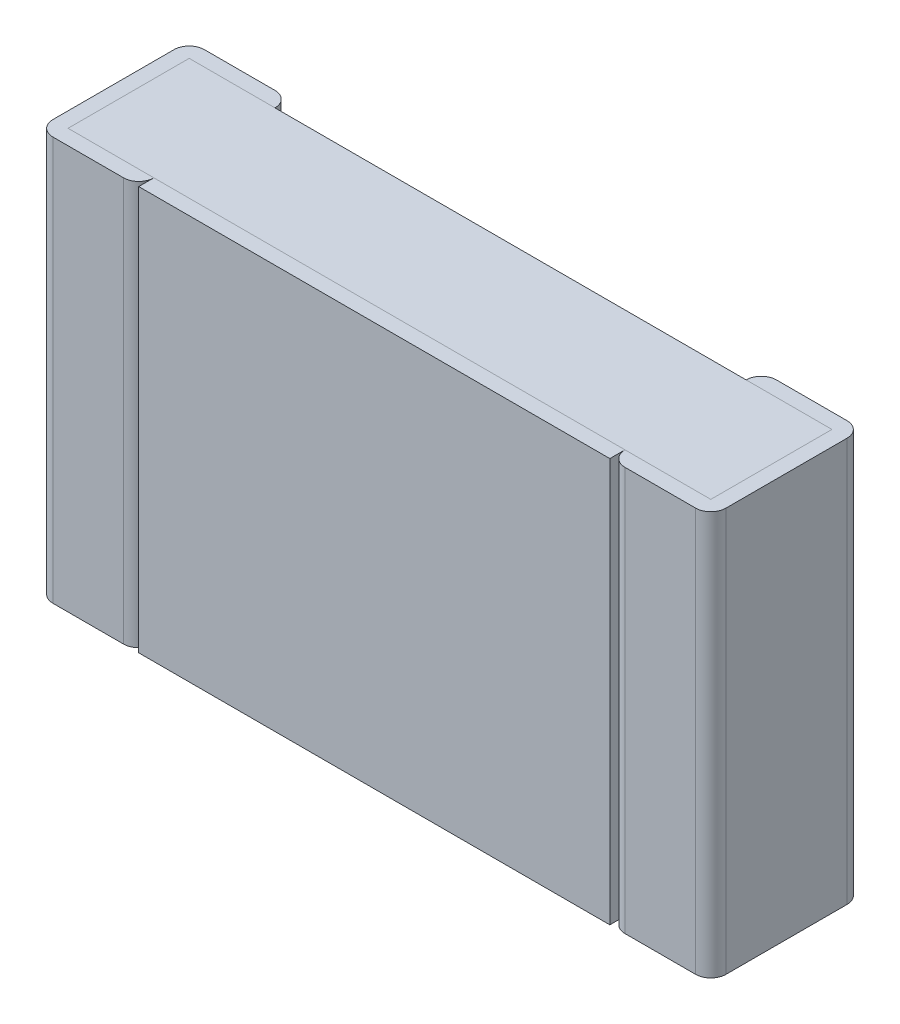
ISO-10303-21;
HEADER;
FILE_DESCRIPTION(('STEP AP214'),'2;1');
FILE_NAME('part.step','',(''),(''),'','','');
FILE_SCHEMA(('AUTOMOTIVE_DESIGN { 1 0 10303 214 1 1 1 1 }'));
ENDSEC;
DATA;
#1=APPLICATION_CONTEXT('core data for automotive mechanical design processes');
#2=APPLICATION_PROTOCOL_DEFINITION('international standard','automotive_design',2000,#1);
#3=PRODUCT_CONTEXT('',#1,'mechanical');
#4=PRODUCT('Part','Part','',(#3));
#5=PRODUCT_RELATED_PRODUCT_CATEGORY('part','',(#4));
#6=PRODUCT_DEFINITION_FORMATION('','',#4);
#7=PRODUCT_DEFINITION_CONTEXT('part definition',#1,'design');
#8=PRODUCT_DEFINITION('design','',#6,#7);
#9=PRODUCT_DEFINITION_SHAPE('','',#8);
#10=(LENGTH_UNIT() NAMED_UNIT(*) SI_UNIT(.MILLI.,.METRE.));
#11=(NAMED_UNIT(*) PLANE_ANGLE_UNIT() SI_UNIT($,.RADIAN.));
#12=(NAMED_UNIT(*) SI_UNIT($,.STERADIAN.) SOLID_ANGLE_UNIT());
#13=UNCERTAINTY_MEASURE_WITH_UNIT(LENGTH_MEASURE(1.E-05),#10,'distance_accuracy_value','');
#14=(GEOMETRIC_REPRESENTATION_CONTEXT(3) GLOBAL_UNCERTAINTY_ASSIGNED_CONTEXT((#13)) GLOBAL_UNIT_ASSIGNED_CONTEXT((#10,
#11,#12)) REPRESENTATION_CONTEXT('',''));
#15=CARTESIAN_POINT('',(0.,0.,0.));
#16=DIRECTION('',(0.,0.,1.));
#17=DIRECTION('',(1.,0.,0.));
#18=AXIS2_PLACEMENT_3D('',#15,#16,#17);
#19=CARTESIAN_POINT('',(-1.,-0.6,0.));
#20=DIRECTION('',(1.,0.,0.));
#21=DIRECTION('',(0.,1.,0.));
#22=AXIS2_PLACEMENT_3D('',#19,#20,#21);
#23=PLANE('',#22);
#24=DIRECTION('',(0.,1.,0.));
#25=VECTOR('',#24,1.);
#26=CARTESIAN_POINT('',(-1.,-0.6,0.405));
#27=LINE('',#26,#25);
#28=CARTESIAN_POINT('',(-1.,-0.6,0.405));
#29=VERTEX_POINT('',#28);
#30=CARTESIAN_POINT('',(-1.,0.6,0.405));
#31=VERTEX_POINT('',#30);
#32=EDGE_CURVE('E11',#29,#31,#27,.T.);
#33=ORIENTED_EDGE('',*,*,#32,.T.);
#34=DIRECTION('',(0.,0.,1.));
#35=VECTOR('',#34,1.);
#36=CARTESIAN_POINT('',(-1.,0.6,0.));
#37=LINE('',#36,#35);
#38=CARTESIAN_POINT('',(-1.,0.6,0.045));
#39=VERTEX_POINT('',#38);
#40=EDGE_CURVE('E41',#39,#31,#37,.T.);
#41=ORIENTED_EDGE('',*,*,#40,.F.);
#42=DIRECTION('',(0.,1.,0.));
#43=VECTOR('',#42,1.);
#44=CARTESIAN_POINT('',(-1.,-0.6,0.045));
#45=LINE('',#44,#43);
#46=CARTESIAN_POINT('',(-1.,-0.6,0.045));
#47=VERTEX_POINT('',#46);
#48=EDGE_CURVE('E252',#47,#39,#45,.T.);
#49=ORIENTED_EDGE('',*,*,#48,.F.);
#50=DIRECTION('',(0.,0.,1.));
#51=VECTOR('',#50,1.);
#52=CARTESIAN_POINT('',(-1.,-0.6,0.));
#53=LINE('',#52,#51);
#54=EDGE_CURVE('E27',#47,#29,#53,.T.);
#55=ORIENTED_EDGE('',*,*,#54,.T.);
#56=EDGE_LOOP('',(#33,#41,#49,#55));
#57=FACE_BOUND('',#56,.T.);
#58=ADVANCED_FACE('F16',(#57),#23,.F.);
#59=CARTESIAN_POINT('',(-1.,-0.6,0.));
#60=DIRECTION('',(0.,1.,0.));
#61=DIRECTION('',(1.,0.,0.));
#62=AXIS2_PLACEMENT_3D('',#59,#60,#61);
#63=PLANE('',#62);
#64=CARTESIAN_POINT('',(-0.745,-0.6,0.045));
#65=DIRECTION('',(0.,1.,0.));
#66=DIRECTION('',(0.,0.,1.));
#67=AXIS2_PLACEMENT_3D('',#64,#65,#66);
#68=CIRCLE('',#67,0.045);
#69=CARTESIAN_POINT('',(-0.7,-0.6,0.045));
#70=VERTEX_POINT('',#69);
#71=CARTESIAN_POINT('',(-0.745,-0.6,0.));
#72=VERTEX_POINT('',#71);
#73=EDGE_CURVE('E214',#70,#72,#68,.T.);
#74=ORIENTED_EDGE('',*,*,#73,.F.);
#75=DIRECTION('',(1.,0.,0.));
#76=VECTOR('',#75,1.);
#77=CARTESIAN_POINT('',(-0.955,-0.6,0.045));
#78=LINE('',#77,#76);
#79=CARTESIAN_POINT('',(-0.955,-0.6,0.045));
#80=VERTEX_POINT('',#79);
#81=EDGE_CURVE('E199',#80,#70,#78,.T.);
#82=ORIENTED_EDGE('',*,*,#81,.F.);
#83=DIRECTION('',(0.,0.,1.));
#84=VECTOR('',#83,1.);
#85=CARTESIAN_POINT('',(-0.955,-0.6,0.045));
#86=LINE('',#85,#84);
#87=CARTESIAN_POINT('',(-0.955,-0.6,0.405));
#88=VERTEX_POINT('',#87);
#89=EDGE_CURVE('E320',#80,#88,#86,.T.);
#90=ORIENTED_EDGE('',*,*,#89,.T.);
#91=DIRECTION('',(1.,0.,0.));
#92=VECTOR('',#91,1.);
#93=CARTESIAN_POINT('',(-0.955,-0.6,0.405));
#94=LINE('',#93,#92);
#95=CARTESIAN_POINT('',(-0.7,-0.6,0.405));
#96=VERTEX_POINT('',#95);
#97=EDGE_CURVE('E388',#88,#96,#94,.T.);
#98=ORIENTED_EDGE('',*,*,#97,.T.);
#99=CARTESIAN_POINT('',(-0.745,-0.6,0.405));
#100=DIRECTION('',(0.,-1.,0.));
#101=DIRECTION('',(0.,0.,1.));
#102=AXIS2_PLACEMENT_3D('',#99,#100,#101);
#103=CIRCLE('',#102,0.045);
#104=CARTESIAN_POINT('',(-0.745,-0.6,0.45));
#105=VERTEX_POINT('',#104);
#106=EDGE_CURVE('E344',#96,#105,#103,.T.);
#107=ORIENTED_EDGE('',*,*,#106,.T.);
#108=DIRECTION('',(1.,0.,0.));
#109=VECTOR('',#108,1.);
#110=CARTESIAN_POINT('',(-1.,-0.6,0.45));
#111=LINE('',#110,#109);
#112=CARTESIAN_POINT('',(-0.955,-0.6,0.45));
#113=VERTEX_POINT('',#112);
#114=EDGE_CURVE('E205',#113,#105,#111,.T.);
#115=ORIENTED_EDGE('',*,*,#114,.F.);
#116=CARTESIAN_POINT('',(-0.955,-0.6,0.405));
#117=DIRECTION('',(0.,1.,0.));
#118=DIRECTION('',(0.,0.,1.));
#119=AXIS2_PLACEMENT_3D('',#116,#117,#118);
#120=CIRCLE('',#119,0.045);
#121=EDGE_CURVE('E209',#29,#113,#120,.T.);
#122=ORIENTED_EDGE('',*,*,#121,.F.);
#123=ORIENTED_EDGE('',*,*,#54,.F.);
#124=CARTESIAN_POINT('',(-0.955,-0.6,0.045));
#125=DIRECTION('',(0.,-1.,0.));
#126=DIRECTION('',(0.,0.,1.));
#127=AXIS2_PLACEMENT_3D('',#124,#125,#126);
#128=CIRCLE('',#127,0.045);
#129=CARTESIAN_POINT('',(-0.955,-0.6,0.));
#130=VERTEX_POINT('',#129);
#131=EDGE_CURVE('E251',#47,#130,#128,.T.);
#132=ORIENTED_EDGE('',*,*,#131,.T.);
#133=DIRECTION('',(1.,0.,0.));
#134=VECTOR('',#133,1.);
#135=CARTESIAN_POINT('',(-1.,-0.6,0.));
#136=LINE('',#135,#134);
#137=EDGE_CURVE('E247',#130,#72,#136,.T.);
#138=ORIENTED_EDGE('',*,*,#137,.T.);
#139=EDGE_LOOP('',(#74,#82,#90,#98,#107,#115,#122,#123,#132,#138));
#140=FACE_BOUND('',#139,.T.);
#141=ADVANCED_FACE('F447',(#140),#63,.F.);
#142=CARTESIAN_POINT('',(-0.955,-0.6,0.045));
#143=DIRECTION('',(0.,1.,0.));
#144=DIRECTION('',(-1.,0.,0.));
#145=AXIS2_PLACEMENT_3D('',#142,#143,#144);
#146=CYLINDRICAL_SURFACE('',#145,0.045);
#147=ORIENTED_EDGE('',*,*,#48,.T.);
#148=CARTESIAN_POINT('',(-0.955,0.6,0.045));
#149=DIRECTION('',(0.,-1.,0.));
#150=DIRECTION('',(0.,0.,1.));
#151=AXIS2_PLACEMENT_3D('',#148,#149,#150);
#152=CIRCLE('',#151,0.045);
#153=CARTESIAN_POINT('',(-0.955,0.6,0.));
#154=VERTEX_POINT('',#153);
#155=EDGE_CURVE('E381',#39,#154,#152,.T.);
#156=ORIENTED_EDGE('',*,*,#155,.T.);
#157=DIRECTION('',(0.,1.,0.));
#158=VECTOR('',#157,1.);
#159=CARTESIAN_POINT('',(-0.955,-0.6,0.));
#160=LINE('',#159,#158);
#161=EDGE_CURVE('E215',#130,#154,#160,.T.);
#162=ORIENTED_EDGE('',*,*,#161,.F.);
#163=ORIENTED_EDGE('',*,*,#131,.F.);
#164=EDGE_LOOP('',(#147,#156,#162,#163));
#165=FACE_BOUND('',#164,.T.);
#166=ADVANCED_FACE('F540',(#165),#146,.T.);
#167=CARTESIAN_POINT('',(-0.955,-0.6,0.405));
#168=DIRECTION('',(0.,1.,0.));
#169=DIRECTION('',(-1.,0.,0.));
#170=AXIS2_PLACEMENT_3D('',#167,#168,#169);
#171=CYLINDRICAL_SURFACE('',#170,0.045);
#172=ORIENTED_EDGE('',*,*,#121,.T.);
#173=DIRECTION('',(0.,1.,0.));
#174=VECTOR('',#173,1.);
#175=CARTESIAN_POINT('',(-0.955,-0.6,0.45));
#176=LINE('',#175,#174);
#177=CARTESIAN_POINT('',(-0.955,0.6,0.45));
#178=VERTEX_POINT('',#177);
#179=EDGE_CURVE('E253',#113,#178,#176,.T.);
#180=ORIENTED_EDGE('',*,*,#179,.T.);
#181=CARTESIAN_POINT('',(-0.955,0.6,0.405));
#182=DIRECTION('',(0.,1.,0.));
#183=DIRECTION('',(0.,0.,1.));
#184=AXIS2_PLACEMENT_3D('',#181,#182,#183);
#185=CIRCLE('',#184,0.045);
#186=EDGE_CURVE('E271',#31,#178,#185,.T.);
#187=ORIENTED_EDGE('',*,*,#186,.F.);
#188=ORIENTED_EDGE('',*,*,#32,.F.);
#189=EDGE_LOOP('',(#172,#180,#187,#188));
#190=FACE_BOUND('',#189,.T.);
#191=ADVANCED_FACE('F521',(#190),#171,.T.);
#192=CARTESIAN_POINT('',(-1.,0.6,0.));
#193=DIRECTION('',(0.,1.,0.));
#194=DIRECTION('',(1.,0.,0.));
#195=AXIS2_PLACEMENT_3D('',#192,#193,#194);
#196=PLANE('',#195);
#197=DIRECTION('',(1.,0.,0.));
#198=VECTOR('',#197,1.);
#199=CARTESIAN_POINT('',(-1.,0.6,0.));
#200=LINE('',#199,#198);
#201=CARTESIAN_POINT('',(-0.745,0.6,0.));
#202=VERTEX_POINT('',#201);
#203=EDGE_CURVE('E219',#154,#202,#200,.T.);
#204=ORIENTED_EDGE('',*,*,#203,.F.);
#205=ORIENTED_EDGE('',*,*,#155,.F.);
#206=ORIENTED_EDGE('',*,*,#40,.T.);
#207=ORIENTED_EDGE('',*,*,#186,.T.);
#208=DIRECTION('',(1.,0.,0.));
#209=VECTOR('',#208,1.);
#210=CARTESIAN_POINT('',(-1.,0.6,0.45));
#211=LINE('',#210,#209);
#212=CARTESIAN_POINT('',(-0.745,0.6,0.45));
#213=VERTEX_POINT('',#212);
#214=EDGE_CURVE('E267',#178,#213,#211,.T.);
#215=ORIENTED_EDGE('',*,*,#214,.T.);
#216=CARTESIAN_POINT('',(-0.745,0.6,0.405));
#217=DIRECTION('',(0.,-1.,0.));
#218=DIRECTION('',(0.,0.,1.));
#219=AXIS2_PLACEMENT_3D('',#216,#217,#218);
#220=CIRCLE('',#219,0.045);
#221=CARTESIAN_POINT('',(-0.7,0.6,0.405));
#222=VERTEX_POINT('',#221);
#223=EDGE_CURVE('E314',#222,#213,#220,.T.);
#224=ORIENTED_EDGE('',*,*,#223,.F.);
#225=DIRECTION('',(1.,0.,0.));
#226=VECTOR('',#225,1.);
#227=CARTESIAN_POINT('',(-0.955,0.6,0.405));
#228=LINE('',#227,#226);
#229=CARTESIAN_POINT('',(-0.955,0.6,0.405));
#230=VERTEX_POINT('',#229);
#231=EDGE_CURVE('E220',#230,#222,#228,.T.);
#232=ORIENTED_EDGE('',*,*,#231,.F.);
#233=DIRECTION('',(0.,0.,1.));
#234=VECTOR('',#233,1.);
#235=CARTESIAN_POINT('',(-0.955,0.6,0.045));
#236=LINE('',#235,#234);
#237=CARTESIAN_POINT('',(-0.955,0.6,0.045));
#238=VERTEX_POINT('',#237);
#239=EDGE_CURVE('E224',#238,#230,#236,.T.);
#240=ORIENTED_EDGE('',*,*,#239,.F.);
#241=DIRECTION('',(1.,0.,0.));
#242=VECTOR('',#241,1.);
#243=CARTESIAN_POINT('',(-0.955,0.6,0.045));
#244=LINE('',#243,#242);
#245=CARTESIAN_POINT('',(-0.7,0.6,0.045));
#246=VERTEX_POINT('',#245);
#247=EDGE_CURVE('E272',#238,#246,#244,.T.);
#248=ORIENTED_EDGE('',*,*,#247,.T.);
#249=CARTESIAN_POINT('',(-0.745,0.6,0.045));
#250=DIRECTION('',(0.,1.,0.));
#251=DIRECTION('',(0.,0.,1.));
#252=AXIS2_PLACEMENT_3D('',#249,#250,#251);
#253=CIRCLE('',#252,0.045);
#254=EDGE_CURVE('E218',#246,#202,#253,.T.);
#255=ORIENTED_EDGE('',*,*,#254,.T.);
#256=EDGE_LOOP('',(#204,#205,#206,#207,#215,#224,#232,#240,#248,#255));
#257=FACE_BOUND('',#256,.T.);
#258=ADVANCED_FACE('F528',(#257),#196,.T.);
#259=CARTESIAN_POINT('',(-1.,-0.6,0.));
#260=DIRECTION('',(0.,0.,1.));
#261=DIRECTION('',(1.,0.,0.));
#262=AXIS2_PLACEMENT_3D('',#259,#260,#261);
#263=PLANE('',#262);
#264=DIRECTION('',(0.,1.,0.));
#265=VECTOR('',#264,1.);
#266=CARTESIAN_POINT('',(-0.745,-0.6,0.));
#267=LINE('',#266,#265);
#268=EDGE_CURVE('E211',#72,#202,#267,.T.);
#269=ORIENTED_EDGE('',*,*,#268,.F.);
#270=ORIENTED_EDGE('',*,*,#137,.F.);
#271=ORIENTED_EDGE('',*,*,#161,.T.);
#272=ORIENTED_EDGE('',*,*,#203,.T.);
#273=EDGE_LOOP('',(#269,#270,#271,#272));
#274=FACE_BOUND('',#273,.T.);
#275=ADVANCED_FACE('F536',(#274),#263,.F.);
#276=CARTESIAN_POINT('',(-0.745,-0.6,0.045));
#277=DIRECTION('',(0.,1.,0.));
#278=DIRECTION('',(1.,0.,0.));
#279=AXIS2_PLACEMENT_3D('',#276,#277,#278);
#280=CYLINDRICAL_SURFACE('',#279,0.045);
#281=ORIENTED_EDGE('',*,*,#73,.T.);
#282=ORIENTED_EDGE('',*,*,#268,.T.);
#283=ORIENTED_EDGE('',*,*,#254,.F.);
#284=DIRECTION('',(0.,1.,0.));
#285=VECTOR('',#284,1.);
#286=CARTESIAN_POINT('',(-0.7,-0.6,0.045));
#287=LINE('',#286,#285);
#288=EDGE_CURVE('E276',#70,#246,#287,.T.);
#289=ORIENTED_EDGE('',*,*,#288,.F.);
#290=EDGE_LOOP('',(#281,#282,#283,#289));
#291=FACE_BOUND('',#290,.T.);
#292=ADVANCED_FACE('F534',(#291),#280,.T.);
#293=CARTESIAN_POINT('',(-0.955,-0.6,0.045));
#294=DIRECTION('',(0.,1.,0.));
#295=DIRECTION('',(1.,0.,0.));
#296=AXIS2_PLACEMENT_3D('',#293,#294,#295);
#297=PLANE('',#296);
#298=DIRECTION('',(1.,0.,0.));
#299=VECTOR('',#298,1.);
#300=CARTESIAN_POINT('',(-0.955,-0.6,0.045));
#301=LINE('',#300,#299);
#302=CARTESIAN_POINT('',(0.7,-0.6,0.045));
#303=VERTEX_POINT('',#302);
#304=EDGE_CURVE('E190',#70,#303,#301,.T.);
#305=ORIENTED_EDGE('',*,*,#304,.T.);
#306=DIRECTION('',(1.,0.,0.));
#307=VECTOR('',#306,1.);
#308=CARTESIAN_POINT('',(-0.955,-0.6,0.045));
#309=LINE('',#308,#307);
#310=CARTESIAN_POINT('',(0.955,-0.6,0.045));
#311=VERTEX_POINT('',#310);
#312=EDGE_CURVE('E182',#303,#311,#309,.T.);
#313=ORIENTED_EDGE('',*,*,#312,.T.);
#314=DIRECTION('',(0.,0.,1.));
#315=VECTOR('',#314,1.);
#316=CARTESIAN_POINT('',(0.955,-0.6,0.045));
#317=LINE('',#316,#315);
#318=CARTESIAN_POINT('',(0.955,-0.6,0.405));
#319=VERTEX_POINT('',#318);
#320=EDGE_CURVE('E186',#311,#319,#317,.T.);
#321=ORIENTED_EDGE('',*,*,#320,.T.);
#322=DIRECTION('',(1.,0.,0.));
#323=VECTOR('',#322,1.);
#324=CARTESIAN_POINT('',(-0.955,-0.6,0.405));
#325=LINE('',#324,#323);
#326=CARTESIAN_POINT('',(0.7,-0.6,0.405));
#327=VERTEX_POINT('',#326);
#328=EDGE_CURVE('E197',#327,#319,#325,.T.);
#329=ORIENTED_EDGE('',*,*,#328,.F.);
#330=DIRECTION('',(1.,0.,0.));
#331=VECTOR('',#330,1.);
#332=CARTESIAN_POINT('',(-0.7,-0.6,0.405));
#333=LINE('',#332,#331);
#334=EDGE_CURVE('E304',#96,#327,#333,.T.);
#335=ORIENTED_EDGE('',*,*,#334,.F.);
#336=ORIENTED_EDGE('',*,*,#97,.F.);
#337=ORIENTED_EDGE('',*,*,#89,.F.);
#338=ORIENTED_EDGE('',*,*,#81,.T.);
#339=EDGE_LOOP('',(#305,#313,#321,#329,#335,#336,#337,#338));
#340=FACE_BOUND('',#339,.T.);
#341=ADVANCED_FACE('F184',(#340),#297,.F.);
#342=CARTESIAN_POINT('',(-1.,-0.6,0.45));
#343=DIRECTION('',(0.,0.,1.));
#344=DIRECTION('',(1.,0.,0.));
#345=AXIS2_PLACEMENT_3D('',#342,#343,#344);
#346=PLANE('',#345);
#347=ORIENTED_EDGE('',*,*,#214,.F.);
#348=ORIENTED_EDGE('',*,*,#179,.F.);
#349=ORIENTED_EDGE('',*,*,#114,.T.);
#350=DIRECTION('',(0.,1.,0.));
#351=VECTOR('',#350,1.);
#352=CARTESIAN_POINT('',(-0.745,-0.6,0.45));
#353=LINE('',#352,#351);
#354=EDGE_CURVE('E257',#105,#213,#353,.T.);
#355=ORIENTED_EDGE('',*,*,#354,.T.);
#356=EDGE_LOOP('',(#347,#348,#349,#355));
#357=FACE_BOUND('',#356,.T.);
#358=ADVANCED_FACE('F526',(#357),#346,.T.);
#359=CARTESIAN_POINT('',(-0.745,-0.6,0.405));
#360=DIRECTION('',(0.,1.,0.));
#361=DIRECTION('',(1.,0.,0.));
#362=AXIS2_PLACEMENT_3D('',#359,#360,#361);
#363=CYLINDRICAL_SURFACE('',#362,0.045);
#364=DIRECTION('',(0.,1.,0.));
#365=VECTOR('',#364,1.);
#366=CARTESIAN_POINT('',(-0.7,-0.6,0.405));
#367=LINE('',#366,#365);
#368=EDGE_CURVE('E261',#96,#222,#367,.T.);
#369=ORIENTED_EDGE('',*,*,#368,.T.);
#370=ORIENTED_EDGE('',*,*,#223,.T.);
#371=ORIENTED_EDGE('',*,*,#354,.F.);
#372=ORIENTED_EDGE('',*,*,#106,.F.);
#373=EDGE_LOOP('',(#369,#370,#371,#372));
#374=FACE_BOUND('',#373,.T.);
#375=ADVANCED_FACE('F441',(#374),#363,.T.);
#376=CARTESIAN_POINT('',(-0.955,0.6,0.045));
#377=DIRECTION('',(0.,1.,0.));
#378=DIRECTION('',(1.,0.,0.));
#379=AXIS2_PLACEMENT_3D('',#376,#377,#378);
#380=PLANE('',#379);
#381=ORIENTED_EDGE('',*,*,#247,.F.);
#382=ORIENTED_EDGE('',*,*,#239,.T.);
#383=ORIENTED_EDGE('',*,*,#231,.T.);
#384=DIRECTION('',(1.,0.,0.));
#385=VECTOR('',#384,1.);
#386=CARTESIAN_POINT('',(-0.7,0.6,0.405));
#387=LINE('',#386,#385);
#388=CARTESIAN_POINT('',(0.7,0.6,0.405));
#389=VERTEX_POINT('',#388);
#390=EDGE_CURVE('E225',#222,#389,#387,.T.);
#391=ORIENTED_EDGE('',*,*,#390,.T.);
#392=DIRECTION('',(1.,0.,0.));
#393=VECTOR('',#392,1.);
#394=CARTESIAN_POINT('',(-0.955,0.6,0.405));
#395=LINE('',#394,#393);
#396=CARTESIAN_POINT('',(0.955,0.6,0.405));
#397=VERTEX_POINT('',#396);
#398=EDGE_CURVE('E234',#389,#397,#395,.T.);
#399=ORIENTED_EDGE('',*,*,#398,.T.);
#400=DIRECTION('',(0.,0.,1.));
#401=VECTOR('',#400,1.);
#402=CARTESIAN_POINT('',(0.955,0.6,0.045));
#403=LINE('',#402,#401);
#404=CARTESIAN_POINT('',(0.955,0.6,0.045));
#405=VERTEX_POINT('',#404);
#406=EDGE_CURVE('E299',#405,#397,#403,.T.);
#407=ORIENTED_EDGE('',*,*,#406,.F.);
#408=DIRECTION('',(1.,0.,0.));
#409=VECTOR('',#408,1.);
#410=CARTESIAN_POINT('',(-0.955,0.6,0.045));
#411=LINE('',#410,#409);
#412=CARTESIAN_POINT('',(0.7,0.6,0.045));
#413=VERTEX_POINT('',#412);
#414=EDGE_CURVE('E303',#413,#405,#411,.T.);
#415=ORIENTED_EDGE('',*,*,#414,.F.);
#416=DIRECTION('',(1.,0.,0.));
#417=VECTOR('',#416,1.);
#418=CARTESIAN_POINT('',(-0.955,0.6,0.045));
#419=LINE('',#418,#417);
#420=EDGE_CURVE('E237',#246,#413,#419,.T.);
#421=ORIENTED_EDGE('',*,*,#420,.F.);
#422=EDGE_LOOP('',(#381,#382,#383,#391,#399,#407,#415,#421));
#423=FACE_BOUND('',#422,.T.);
#424=ADVANCED_FACE('F418',(#423),#380,.T.);
#425=CARTESIAN_POINT('',(-0.955,-0.6,0.045));
#426=DIRECTION('',(0.,0.,1.));
#427=DIRECTION('',(1.,0.,0.));
#428=AXIS2_PLACEMENT_3D('',#425,#426,#427);
#429=PLANE('',#428);
#430=ORIENTED_EDGE('',*,*,#420,.T.);
#431=DIRECTION('',(0.,1.,0.));
#432=VECTOR('',#431,1.);
#433=CARTESIAN_POINT('',(0.7,-0.6,0.045));
#434=LINE('',#433,#432);
#435=EDGE_CURVE('E508',#303,#413,#434,.T.);
#436=ORIENTED_EDGE('',*,*,#435,.F.);
#437=ORIENTED_EDGE('',*,*,#304,.F.);
#438=ORIENTED_EDGE('',*,*,#288,.T.);
#439=EDGE_LOOP('',(#430,#436,#437,#438));
#440=FACE_BOUND('',#439,.T.);
#441=ADVANCED_FACE('F543',(#440),#429,.F.);
#442=CARTESIAN_POINT('',(0.7,-0.6,0.));
#443=DIRECTION('',(0.,1.,0.));
#444=DIRECTION('',(1.,0.,0.));
#445=AXIS2_PLACEMENT_3D('',#442,#443,#444);
#446=PLANE('',#445);
#447=CARTESIAN_POINT('',(0.955,-0.6,0.045));
#448=DIRECTION('',(0.,1.,0.));
#449=DIRECTION('',(0.,0.,1.));
#450=AXIS2_PLACEMENT_3D('',#447,#448,#449);
#451=CIRCLE('',#450,0.045);
#452=CARTESIAN_POINT('',(1.,-0.6,0.045));
#453=VERTEX_POINT('',#452);
#454=CARTESIAN_POINT('',(0.955,-0.6,0.));
#455=VERTEX_POINT('',#454);
#456=EDGE_CURVE('E321',#453,#455,#451,.T.);
#457=ORIENTED_EDGE('',*,*,#456,.F.);
#458=DIRECTION('',(0.,0.,1.));
#459=VECTOR('',#458,1.);
#460=CARTESIAN_POINT('',(1.,-0.6,0.));
#461=LINE('',#460,#459);
#462=CARTESIAN_POINT('',(1.,-0.6,0.405));
#463=VERTEX_POINT('',#462);
#464=EDGE_CURVE('E266',#453,#463,#461,.T.);
#465=ORIENTED_EDGE('',*,*,#464,.T.);
#466=CARTESIAN_POINT('',(0.955,-0.6,0.405));
#467=DIRECTION('',(0.,-1.,0.));
#468=DIRECTION('',(0.,0.,1.));
#469=AXIS2_PLACEMENT_3D('',#466,#467,#468);
#470=CIRCLE('',#469,0.045);
#471=CARTESIAN_POINT('',(0.955,-0.6,0.45));
#472=VERTEX_POINT('',#471);
#473=EDGE_CURVE('E262',#463,#472,#470,.T.);
#474=ORIENTED_EDGE('',*,*,#473,.T.);
#475=DIRECTION('',(1.,0.,0.));
#476=VECTOR('',#475,1.);
#477=CARTESIAN_POINT('',(0.7,-0.6,0.45));
#478=LINE('',#477,#476);
#479=CARTESIAN_POINT('',(0.745,-0.6,0.45));
#480=VERTEX_POINT('',#479);
#481=EDGE_CURVE('E287',#480,#472,#478,.T.);
#482=ORIENTED_EDGE('',*,*,#481,.F.);
#483=CARTESIAN_POINT('',(0.745,-0.6,0.405));
#484=DIRECTION('',(0.,1.,0.));
#485=DIRECTION('',(0.,0.,1.));
#486=AXIS2_PLACEMENT_3D('',#483,#484,#485);
#487=CIRCLE('',#486,0.045);
#488=EDGE_CURVE('E288',#327,#480,#487,.T.);
#489=ORIENTED_EDGE('',*,*,#488,.F.);
#490=ORIENTED_EDGE('',*,*,#328,.T.);
#491=ORIENTED_EDGE('',*,*,#320,.F.);
#492=ORIENTED_EDGE('',*,*,#312,.F.);
#493=CARTESIAN_POINT('',(0.745,-0.6,0.045));
#494=DIRECTION('',(0.,-1.,0.));
#495=DIRECTION('',(0.,0.,1.));
#496=AXIS2_PLACEMENT_3D('',#493,#494,#495);
#497=CIRCLE('',#496,0.045);
#498=CARTESIAN_POINT('',(0.745,-0.6,0.));
#499=VERTEX_POINT('',#498);
#500=EDGE_CURVE('E362',#303,#499,#497,.T.);
#501=ORIENTED_EDGE('',*,*,#500,.T.);
#502=DIRECTION('',(1.,0.,0.));
#503=VECTOR('',#502,1.);
#504=CARTESIAN_POINT('',(0.7,-0.6,0.));
#505=LINE('',#504,#503);
#506=EDGE_CURVE('E369',#499,#455,#505,.T.);
#507=ORIENTED_EDGE('',*,*,#506,.T.);
#508=EDGE_LOOP('',(#457,#465,#474,#482,#489,#490,#491,#492,#501,#507));
#509=FACE_BOUND('',#508,.T.);
#510=ADVANCED_FACE('F196',(#509),#446,.F.);
#511=CARTESIAN_POINT('',(-0.7,-0.6,0.405));
#512=DIRECTION('',(0.,1.,0.));
#513=DIRECTION('',(1.,0.,0.));
#514=AXIS2_PLACEMENT_3D('',#511,#512,#513);
#515=PLANE('',#514);
#516=DIRECTION('',(0.,0.,1.));
#517=VECTOR('',#516,1.);
#518=CARTESIAN_POINT('',(0.7,-0.6,0.405));
#519=LINE('',#518,#517);
#520=CARTESIAN_POINT('',(0.7,-0.6,0.45));
#521=VERTEX_POINT('',#520);
#522=EDGE_CURVE('E308',#327,#521,#519,.T.);
#523=ORIENTED_EDGE('',*,*,#522,.T.);
#524=DIRECTION('',(1.,0.,0.));
#525=VECTOR('',#524,1.);
#526=CARTESIAN_POINT('',(-0.7,-0.6,0.45));
#527=LINE('',#526,#525);
#528=CARTESIAN_POINT('',(-0.7,-0.6,0.45));
#529=VERTEX_POINT('',#528);
#530=EDGE_CURVE('E291',#529,#521,#527,.T.);
#531=ORIENTED_EDGE('',*,*,#530,.F.);
#532=DIRECTION('',(0.,0.,1.));
#533=VECTOR('',#532,1.);
#534=CARTESIAN_POINT('',(-0.7,-0.6,0.405));
#535=LINE('',#534,#533);
#536=EDGE_CURVE('E313',#96,#529,#535,.T.);
#537=ORIENTED_EDGE('',*,*,#536,.F.);
#538=ORIENTED_EDGE('',*,*,#334,.T.);
#539=EDGE_LOOP('',(#523,#531,#537,#538));
#540=FACE_BOUND('',#539,.T.);
#541=ADVANCED_FACE('F450',(#540),#515,.F.);
#542=CARTESIAN_POINT('',(-0.7,-0.6,0.405));
#543=DIRECTION('',(1.,0.,0.));
#544=DIRECTION('',(0.,1.,0.));
#545=AXIS2_PLACEMENT_3D('',#542,#543,#544);
#546=PLANE('',#545);
#547=DIRECTION('',(0.,1.,0.));
#548=VECTOR('',#547,1.);
#549=CARTESIAN_POINT('',(-0.7,-0.6,0.45));
#550=LINE('',#549,#548);
#551=CARTESIAN_POINT('',(-0.7,0.6,0.45));
#552=VERTEX_POINT('',#551);
#553=EDGE_CURVE('E309',#529,#552,#550,.T.);
#554=ORIENTED_EDGE('',*,*,#553,.T.);
#555=DIRECTION('',(0.,0.,1.));
#556=VECTOR('',#555,1.);
#557=CARTESIAN_POINT('',(-0.7,0.6,0.405));
#558=LINE('',#557,#556);
#559=EDGE_CURVE('E244',#222,#552,#558,.T.);
#560=ORIENTED_EDGE('',*,*,#559,.F.);
#561=ORIENTED_EDGE('',*,*,#368,.F.);
#562=ORIENTED_EDGE('',*,*,#536,.T.);
#563=EDGE_LOOP('',(#554,#560,#561,#562));
#564=FACE_BOUND('',#563,.T.);
#565=ADVANCED_FACE('F18',(#564),#546,.F.);
#566=CARTESIAN_POINT('',(0.7,0.6,0.));
#567=DIRECTION('',(0.,1.,0.));
#568=DIRECTION('',(1.,0.,0.));
#569=AXIS2_PLACEMENT_3D('',#566,#567,#568);
#570=PLANE('',#569);
#571=DIRECTION('',(1.,0.,0.));
#572=VECTOR('',#571,1.);
#573=CARTESIAN_POINT('',(0.7,0.6,0.));
#574=LINE('',#573,#572);
#575=CARTESIAN_POINT('',(0.745,0.6,0.));
#576=VERTEX_POINT('',#575);
#577=CARTESIAN_POINT('',(0.955,0.6,0.));
#578=VERTEX_POINT('',#577);
#579=EDGE_CURVE('E325',#576,#578,#574,.T.);
#580=ORIENTED_EDGE('',*,*,#579,.F.);
#581=CARTESIAN_POINT('',(0.745,0.6,0.045));
#582=DIRECTION('',(0.,-1.,0.));
#583=DIRECTION('',(0.,0.,1.));
#584=AXIS2_PLACEMENT_3D('',#581,#582,#583);
#585=CIRCLE('',#584,0.045);
#586=EDGE_CURVE('E335',#413,#576,#585,.T.);
#587=ORIENTED_EDGE('',*,*,#586,.F.);
#588=ORIENTED_EDGE('',*,*,#414,.T.);
#589=ORIENTED_EDGE('',*,*,#406,.T.);
#590=ORIENTED_EDGE('',*,*,#398,.F.);
#591=CARTESIAN_POINT('',(0.745,0.6,0.405));
#592=DIRECTION('',(0.,1.,0.));
#593=DIRECTION('',(0.,0.,1.));
#594=AXIS2_PLACEMENT_3D('',#591,#592,#593);
#595=CIRCLE('',#594,0.045);
#596=CARTESIAN_POINT('',(0.745,0.6,0.45));
#597=VERTEX_POINT('',#596);
#598=EDGE_CURVE('E230',#389,#597,#595,.T.);
#599=ORIENTED_EDGE('',*,*,#598,.T.);
#600=DIRECTION('',(1.,0.,0.));
#601=VECTOR('',#600,1.);
#602=CARTESIAN_POINT('',(0.7,0.6,0.45));
#603=LINE('',#602,#601);
#604=CARTESIAN_POINT('',(0.955,0.6,0.45));
#605=VERTEX_POINT('',#604);
#606=EDGE_CURVE('E226',#597,#605,#603,.T.);
#607=ORIENTED_EDGE('',*,*,#606,.T.);
#608=CARTESIAN_POINT('',(0.955,0.6,0.405));
#609=DIRECTION('',(0.,-1.,0.));
#610=DIRECTION('',(0.,0.,1.));
#611=AXIS2_PLACEMENT_3D('',#608,#609,#610);
#612=CIRCLE('',#611,0.045);
#613=CARTESIAN_POINT('',(1.,0.6,0.405));
#614=VERTEX_POINT('',#613);
#615=EDGE_CURVE('E282',#614,#605,#612,.T.);
#616=ORIENTED_EDGE('',*,*,#615,.F.);
#617=DIRECTION('',(0.,0.,1.));
#618=VECTOR('',#617,1.);
#619=CARTESIAN_POINT('',(1.,0.6,0.));
#620=LINE('',#619,#618);
#621=CARTESIAN_POINT('',(1.,0.6,0.045));
#622=VERTEX_POINT('',#621);
#623=EDGE_CURVE('E281',#622,#614,#620,.T.);
#624=ORIENTED_EDGE('',*,*,#623,.F.);
#625=CARTESIAN_POINT('',(0.955,0.6,0.045));
#626=DIRECTION('',(0.,1.,0.));
#627=DIRECTION('',(0.,0.,1.));
#628=AXIS2_PLACEMENT_3D('',#625,#626,#627);
#629=CIRCLE('',#628,0.045);
#630=EDGE_CURVE('E231',#622,#578,#629,.T.);
#631=ORIENTED_EDGE('',*,*,#630,.T.);
#632=EDGE_LOOP('',(#580,#587,#588,#589,#590,#599,#607,#616,#624,#631));
#633=FACE_BOUND('',#632,.T.);
#634=ADVANCED_FACE('F415',(#633),#570,.T.);
#635=CARTESIAN_POINT('',(-0.7,0.6,0.405));
#636=DIRECTION('',(0.,1.,0.));
#637=DIRECTION('',(1.,0.,0.));
#638=AXIS2_PLACEMENT_3D('',#635,#636,#637);
#639=PLANE('',#638);
#640=ORIENTED_EDGE('',*,*,#390,.F.);
#641=ORIENTED_EDGE('',*,*,#559,.T.);
#642=DIRECTION('',(1.,0.,0.));
#643=VECTOR('',#642,1.);
#644=CARTESIAN_POINT('',(-0.7,0.6,0.45));
#645=LINE('',#644,#643);
#646=CARTESIAN_POINT('',(0.7,0.6,0.45));
#647=VERTEX_POINT('',#646);
#648=EDGE_CURVE('E20',#552,#647,#645,.T.);
#649=ORIENTED_EDGE('',*,*,#648,.T.);
#650=DIRECTION('',(0.,0.,1.));
#651=VECTOR('',#650,1.);
#652=CARTESIAN_POINT('',(0.7,0.6,0.405));
#653=LINE('',#652,#651);
#654=EDGE_CURVE('E243',#389,#647,#653,.T.);
#655=ORIENTED_EDGE('',*,*,#654,.F.);
#656=EDGE_LOOP('',(#640,#641,#649,#655));
#657=FACE_BOUND('',#656,.T.);
#658=ADVANCED_FACE('F626',(#657),#639,.T.);
#659=CARTESIAN_POINT('',(0.745,-0.6,0.045));
#660=DIRECTION('',(0.,1.,0.));
#661=DIRECTION('',(-1.,0.,0.));
#662=AXIS2_PLACEMENT_3D('',#659,#660,#661);
#663=CYLINDRICAL_SURFACE('',#662,0.045);
#664=ORIENTED_EDGE('',*,*,#435,.T.);
#665=ORIENTED_EDGE('',*,*,#586,.T.);
#666=DIRECTION('',(0.,1.,0.));
#667=VECTOR('',#666,1.);
#668=CARTESIAN_POINT('',(0.745,-0.6,0.));
#669=LINE('',#668,#667);
#670=EDGE_CURVE('E331',#499,#576,#669,.T.);
#671=ORIENTED_EDGE('',*,*,#670,.F.);
#672=ORIENTED_EDGE('',*,*,#500,.F.);
#673=EDGE_LOOP('',(#664,#665,#671,#672));
#674=FACE_BOUND('',#673,.T.);
#675=ADVANCED_FACE('F545',(#674),#663,.T.);
#676=CARTESIAN_POINT('',(0.7,-0.6,0.));
#677=DIRECTION('',(0.,0.,1.));
#678=DIRECTION('',(1.,0.,0.));
#679=AXIS2_PLACEMENT_3D('',#676,#677,#678);
#680=PLANE('',#679);
#681=DIRECTION('',(0.,1.,0.));
#682=VECTOR('',#681,1.);
#683=CARTESIAN_POINT('',(0.955,-0.6,0.));
#684=LINE('',#683,#682);
#685=EDGE_CURVE('E326',#455,#578,#684,.T.);
#686=ORIENTED_EDGE('',*,*,#685,.F.);
#687=ORIENTED_EDGE('',*,*,#506,.F.);
#688=ORIENTED_EDGE('',*,*,#670,.T.);
#689=ORIENTED_EDGE('',*,*,#579,.T.);
#690=EDGE_LOOP('',(#686,#687,#688,#689));
#691=FACE_BOUND('',#690,.T.);
#692=ADVANCED_FACE('F478',(#691),#680,.F.);
#693=CARTESIAN_POINT('',(0.955,-0.6,0.045));
#694=DIRECTION('',(0.,1.,0.));
#695=DIRECTION('',(1.,0.,0.));
#696=AXIS2_PLACEMENT_3D('',#693,#694,#695);
#697=CYLINDRICAL_SURFACE('',#696,0.045);
#698=ORIENTED_EDGE('',*,*,#456,.T.);
#699=ORIENTED_EDGE('',*,*,#685,.T.);
#700=ORIENTED_EDGE('',*,*,#630,.F.);
#701=DIRECTION('',(0.,1.,0.));
#702=VECTOR('',#701,1.);
#703=CARTESIAN_POINT('',(1.,-0.6,0.045));
#704=LINE('',#703,#702);
#705=EDGE_CURVE('E330',#453,#622,#704,.T.);
#706=ORIENTED_EDGE('',*,*,#705,.F.);
#707=EDGE_LOOP('',(#698,#699,#700,#706));
#708=FACE_BOUND('',#707,.T.);
#709=ADVANCED_FACE('F489',(#708),#697,.T.);
#710=CARTESIAN_POINT('',(1.,-0.6,0.));
#711=DIRECTION('',(1.,0.,0.));
#712=DIRECTION('',(0.,1.,0.));
#713=AXIS2_PLACEMENT_3D('',#710,#711,#712);
#714=PLANE('',#713);
#715=ORIENTED_EDGE('',*,*,#464,.F.);
#716=ORIENTED_EDGE('',*,*,#705,.T.);
#717=ORIENTED_EDGE('',*,*,#623,.T.);
#718=DIRECTION('',(0.,1.,0.));
#719=VECTOR('',#718,1.);
#720=CARTESIAN_POINT('',(1.,-0.6,0.405));
#721=LINE('',#720,#719);
#722=EDGE_CURVE('E277',#463,#614,#721,.T.);
#723=ORIENTED_EDGE('',*,*,#722,.F.);
#724=EDGE_LOOP('',(#715,#716,#717,#723));
#725=FACE_BOUND('',#724,.T.);
#726=ADVANCED_FACE('F796',(#725),#714,.T.);
#727=CARTESIAN_POINT('',(0.955,-0.6,0.405));
#728=DIRECTION('',(0.,1.,0.));
#729=DIRECTION('',(1.,0.,0.));
#730=AXIS2_PLACEMENT_3D('',#727,#728,#729);
#731=CYLINDRICAL_SURFACE('',#730,0.045);
#732=ORIENTED_EDGE('',*,*,#722,.T.);
#733=ORIENTED_EDGE('',*,*,#615,.T.);
#734=DIRECTION('',(0.,1.,0.));
#735=VECTOR('',#734,1.);
#736=CARTESIAN_POINT('',(0.955,-0.6,0.45));
#737=LINE('',#736,#735);
#738=EDGE_CURVE('E283',#472,#605,#737,.T.);
#739=ORIENTED_EDGE('',*,*,#738,.F.);
#740=ORIENTED_EDGE('',*,*,#473,.F.);
#741=EDGE_LOOP('',(#732,#733,#739,#740));
#742=FACE_BOUND('',#741,.T.);
#743=ADVANCED_FACE('F785',(#742),#731,.T.);
#744=CARTESIAN_POINT('',(0.7,-0.6,0.45));
#745=DIRECTION('',(0.,0.,1.));
#746=DIRECTION('',(1.,0.,0.));
#747=AXIS2_PLACEMENT_3D('',#744,#745,#746);
#748=PLANE('',#747);
#749=ORIENTED_EDGE('',*,*,#606,.F.);
#750=DIRECTION('',(0.,1.,0.));
#751=VECTOR('',#750,1.);
#752=CARTESIAN_POINT('',(0.745,-0.6,0.45));
#753=LINE('',#752,#751);
#754=EDGE_CURVE('E242',#480,#597,#753,.T.);
#755=ORIENTED_EDGE('',*,*,#754,.F.);
#756=ORIENTED_EDGE('',*,*,#481,.T.);
#757=ORIENTED_EDGE('',*,*,#738,.T.);
#758=EDGE_LOOP('',(#749,#755,#756,#757));
#759=FACE_BOUND('',#758,.T.);
#760=ADVANCED_FACE('F410',(#759),#748,.T.);
#761=CARTESIAN_POINT('',(0.745,-0.6,0.405));
#762=DIRECTION('',(0.,1.,0.));
#763=DIRECTION('',(-1.,0.,0.));
#764=AXIS2_PLACEMENT_3D('',#761,#762,#763);
#765=CYLINDRICAL_SURFACE('',#764,0.045);
#766=ORIENTED_EDGE('',*,*,#488,.T.);
#767=ORIENTED_EDGE('',*,*,#754,.T.);
#768=ORIENTED_EDGE('',*,*,#598,.F.);
#769=DIRECTION('',(0.,1.,0.));
#770=VECTOR('',#769,1.);
#771=CARTESIAN_POINT('',(0.7,-0.6,0.405));
#772=LINE('',#771,#770);
#773=EDGE_CURVE('E238',#327,#389,#772,.T.);
#774=ORIENTED_EDGE('',*,*,#773,.F.);
#775=EDGE_LOOP('',(#766,#767,#768,#774));
#776=FACE_BOUND('',#775,.T.);
#777=ADVANCED_FACE('F405',(#776),#765,.T.);
#778=CARTESIAN_POINT('',(0.7,-0.6,0.405));
#779=DIRECTION('',(1.,0.,0.));
#780=DIRECTION('',(0.,1.,0.));
#781=AXIS2_PLACEMENT_3D('',#778,#779,#780);
#782=PLANE('',#781);
#783=ORIENTED_EDGE('',*,*,#522,.F.);
#784=ORIENTED_EDGE('',*,*,#773,.T.);
#785=ORIENTED_EDGE('',*,*,#654,.T.);
#786=DIRECTION('',(0.,1.,0.));
#787=VECTOR('',#786,1.);
#788=CARTESIAN_POINT('',(0.7,-0.6,0.45));
#789=LINE('',#788,#787);
#790=EDGE_CURVE('E295',#521,#647,#789,.T.);
#791=ORIENTED_EDGE('',*,*,#790,.F.);
#792=EDGE_LOOP('',(#783,#784,#785,#791));
#793=FACE_BOUND('',#792,.T.);
#794=ADVANCED_FACE('F424',(#793),#782,.T.);
#795=CARTESIAN_POINT('',(-0.7,-0.6,0.45));
#796=DIRECTION('',(0.,0.,1.));
#797=DIRECTION('',(1.,0.,0.));
#798=AXIS2_PLACEMENT_3D('',#795,#796,#797);
#799=PLANE('',#798);
#800=ORIENTED_EDGE('',*,*,#553,.F.);
#801=ORIENTED_EDGE('',*,*,#530,.T.);
#802=ORIENTED_EDGE('',*,*,#790,.T.);
#803=ORIENTED_EDGE('',*,*,#648,.F.);
#804=EDGE_LOOP('',(#800,#801,#802,#803));
#805=FACE_BOUND('',#804,.T.);
#806=ADVANCED_FACE('F452',(#805),#799,.T.);
#807=CLOSED_SHELL('',(#58,#141,#166,#191,#258,#275,#292,#341,#358,#375,#424,#441,#510,#541,#565,
#634,#658,#675,#692,#709,#726,#743,#760,#777,#794,#806));
#808=MANIFOLD_SOLID_BREP('B1',#807);
#809=ADVANCED_BREP_SHAPE_REPRESENTATION('',(#18,#808),#14);
#810=SHAPE_DEFINITION_REPRESENTATION(#9,#809);
ENDSEC;
END-ISO-10303-21;
